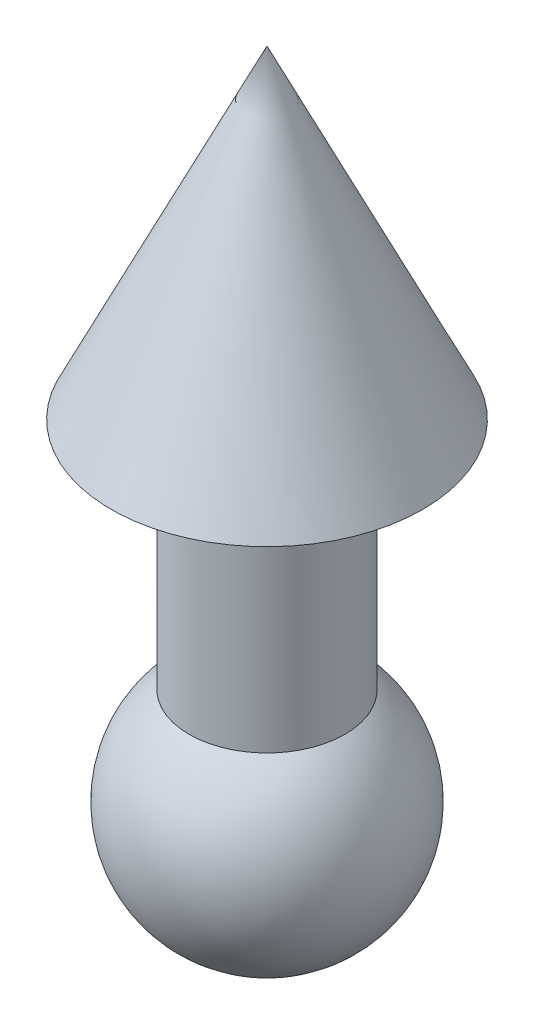
ISO-10303-21;
HEADER;
FILE_DESCRIPTION(('STEP AP214'),'2;1');
FILE_NAME('part.step','',(''),(''),'','','');
FILE_SCHEMA(('AUTOMOTIVE_DESIGN { 1 0 10303 214 1 1 1 1 }'));
ENDSEC;
DATA;
#1=APPLICATION_CONTEXT('core data for automotive mechanical design processes');
#2=APPLICATION_PROTOCOL_DEFINITION('international standard','automotive_design',2000,#1);
#3=PRODUCT_CONTEXT('',#1,'mechanical');
#4=PRODUCT('Part','Part','',(#3));
#5=PRODUCT_RELATED_PRODUCT_CATEGORY('part','',(#4));
#6=PRODUCT_DEFINITION_FORMATION('','',#4);
#7=PRODUCT_DEFINITION_CONTEXT('part definition',#1,'design');
#8=PRODUCT_DEFINITION('design','',#6,#7);
#9=PRODUCT_DEFINITION_SHAPE('','',#8);
#10=(LENGTH_UNIT() NAMED_UNIT(*) SI_UNIT(.MILLI.,.METRE.));
#11=(NAMED_UNIT(*) PLANE_ANGLE_UNIT() SI_UNIT($,.RADIAN.));
#12=(NAMED_UNIT(*) SI_UNIT($,.STERADIAN.) SOLID_ANGLE_UNIT());
#13=UNCERTAINTY_MEASURE_WITH_UNIT(LENGTH_MEASURE(1.E-05),#10,'distance_accuracy_value','');
#14=(GEOMETRIC_REPRESENTATION_CONTEXT(3) GLOBAL_UNCERTAINTY_ASSIGNED_CONTEXT((#13)) GLOBAL_UNIT_ASSIGNED_CONTEXT((#10,
#11,#12)) REPRESENTATION_CONTEXT('',''));
#15=CARTESIAN_POINT('',(0.,0.,0.));
#16=DIRECTION('',(0.,0.,1.));
#17=DIRECTION('',(1.,0.,0.));
#18=AXIS2_PLACEMENT_3D('',#15,#16,#17);
#19=CARTESIAN_POINT('',(5.,21.2449979983984,0.));
#20=DIRECTION('',(0.,1.,0.));
#21=DIRECTION('',(-1.,0.,0.));
#22=AXIS2_PLACEMENT_3D('',#19,#20,#21);
#23=PLANE('',#22);
#24=CARTESIAN_POINT('',(0.,21.2449979983984,0.));
#25=DIRECTION('',(0.,1.,0.));
#26=DIRECTION('',(-1.,0.,0.));
#27=AXIS2_PLACEMENT_3D('',#24,#25,#26);
#28=CIRCLE('',#27,10.);
#29=CARTESIAN_POINT('',(-10.,21.2449979983984,0.));
#30=VERTEX_POINT('',#29);
#31=EDGE_CURVE('E11',#30,#30,#28,.T.);
#32=ORIENTED_EDGE('',*,*,#31,.F.);
#33=EDGE_LOOP('',(#32));
#34=FACE_BOUND('',#33,.T.);
#35=CARTESIAN_POINT('',(0.,21.2449979983984,0.));
#36=DIRECTION('',(0.,1.,0.));
#37=DIRECTION('',(-1.,0.,0.));
#38=AXIS2_PLACEMENT_3D('',#35,#36,#37);
#39=CIRCLE('',#38,5.);
#40=CARTESIAN_POINT('',(-5.,21.2449979983984,0.));
#41=VERTEX_POINT('',#40);
#42=EDGE_CURVE('E60',#41,#41,#39,.T.);
#43=ORIENTED_EDGE('',*,*,#42,.T.);
#44=EDGE_LOOP('',(#43));
#45=FACE_BOUND('',#44,.T.);
#46=ADVANCED_FACE('F41',(#34,#45),#23,.F.);
#47=CARTESIAN_POINT('',(0.,21.2449979983984,0.));
#48=DIRECTION('',(0.,-1.,0.));
#49=DIRECTION('',(1.,0.,0.));
#50=AXIS2_PLACEMENT_3D('',#47,#48,#49);
#51=CONICAL_SURFACE('',#50,10.,0.448991272717563);
#52=CARTESIAN_POINT('',(0.,42.,0.));
#53=VERTEX_POINT('',#52);
#54=VERTEX_LOOP('',#53);
#55=FACE_BOUND('',#54,.T.);
#56=ORIENTED_EDGE('',*,*,#31,.T.);
#57=EDGE_LOOP('',(#56));
#58=FACE_BOUND('',#57,.T.);
#59=ADVANCED_FACE('F50',(#55,#58),#51,.T.);
#60=CARTESIAN_POINT('',(0.,0.,0.));
#61=DIRECTION('',(0.,1.,0.));
#62=DIRECTION('',(1.,0.,0.));
#63=AXIS2_PLACEMENT_3D('',#60,#61,#62);
#64=SPHERICAL_SURFACE('',#63,8.);
#65=CARTESIAN_POINT('',(0.,6.24499799839839,0.));
#66=DIRECTION('',(0.,1.,0.));
#67=DIRECTION('',(-1.,0.,0.));
#68=AXIS2_PLACEMENT_3D('',#65,#66,#67);
#69=CIRCLE('',#68,5.);
#70=CARTESIAN_POINT('',(-5.,6.24499799839839,0.));
#71=VERTEX_POINT('',#70);
#72=EDGE_CURVE('E47',#71,#71,#69,.T.);
#73=ORIENTED_EDGE('',*,*,#72,.F.);
#74=EDGE_LOOP('',(#73));
#75=FACE_BOUND('',#74,.T.);
#76=ADVANCED_FACE('F53',(#75),#64,.T.);
#77=CARTESIAN_POINT('',(0.,42.,0.));
#78=DIRECTION('',(0.,1.,0.));
#79=DIRECTION('',(-1.,0.,0.));
#80=AXIS2_PLACEMENT_3D('',#77,#78,#79);
#81=CYLINDRICAL_SURFACE('',#80,5.);
#82=ORIENTED_EDGE('',*,*,#42,.F.);
#83=EDGE_LOOP('',(#82));
#84=FACE_BOUND('',#83,.T.);
#85=ORIENTED_EDGE('',*,*,#72,.T.);
#86=EDGE_LOOP('',(#85));
#87=FACE_BOUND('',#86,.T.);
#88=ADVANCED_FACE('F66',(#84,#87),#81,.T.);
#89=CLOSED_SHELL('',(#46,#59,#76,#88));
#90=MANIFOLD_SOLID_BREP('B2',#89);
#91=ADVANCED_BREP_SHAPE_REPRESENTATION('',(#18,#90),#14);
#92=SHAPE_DEFINITION_REPRESENTATION(#9,#91);
ENDSEC;
END-ISO-10303-21;
